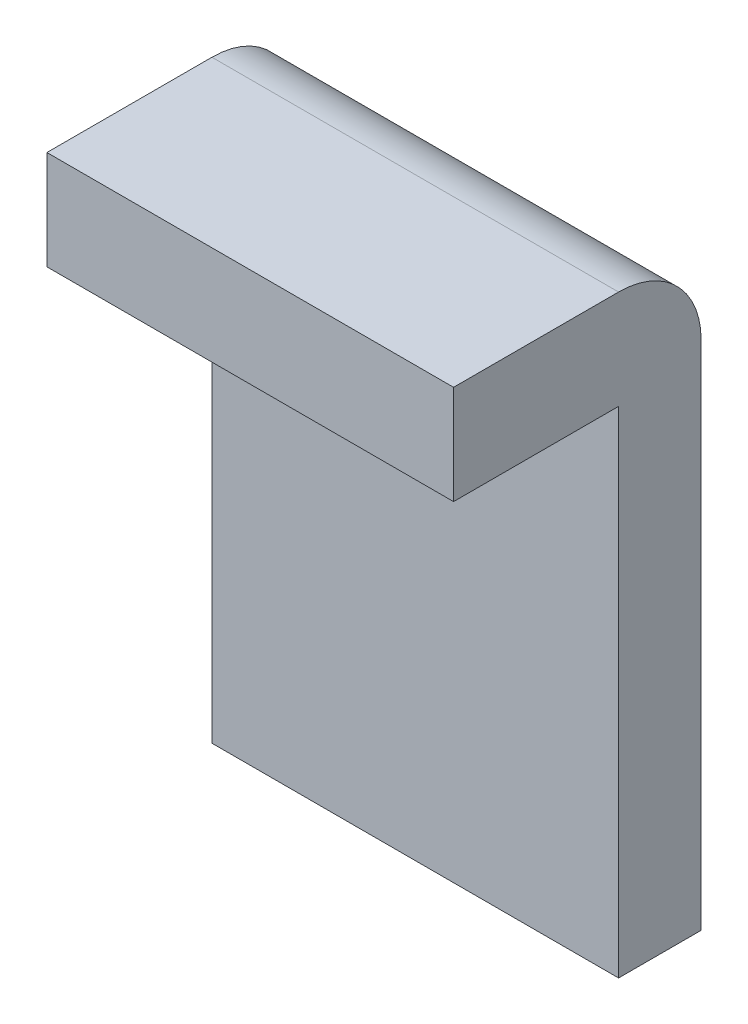
ISO-10303-21;
HEADER;
FILE_DESCRIPTION(('STEP AP214'),'2;1');
FILE_NAME('part.step','',(''),(''),'','','');
FILE_SCHEMA(('AUTOMOTIVE_DESIGN { 1 0 10303 214 1 1 1 1 }'));
ENDSEC;
DATA;
#1=APPLICATION_CONTEXT('core data for automotive mechanical design processes');
#2=APPLICATION_PROTOCOL_DEFINITION('international standard','automotive_design',2000,#1);
#3=PRODUCT_CONTEXT('',#1,'mechanical');
#4=PRODUCT('Part','Part','',(#3));
#5=PRODUCT_RELATED_PRODUCT_CATEGORY('part','',(#4));
#6=PRODUCT_DEFINITION_FORMATION('','',#4);
#7=PRODUCT_DEFINITION_CONTEXT('part definition',#1,'design');
#8=PRODUCT_DEFINITION('design','',#6,#7);
#9=PRODUCT_DEFINITION_SHAPE('','',#8);
#10=(LENGTH_UNIT() NAMED_UNIT(*) SI_UNIT(.MILLI.,.METRE.));
#11=(NAMED_UNIT(*) PLANE_ANGLE_UNIT() SI_UNIT($,.RADIAN.));
#12=(NAMED_UNIT(*) SI_UNIT($,.STERADIAN.) SOLID_ANGLE_UNIT());
#13=UNCERTAINTY_MEASURE_WITH_UNIT(LENGTH_MEASURE(1.E-05),#10,'distance_accuracy_value','');
#14=(GEOMETRIC_REPRESENTATION_CONTEXT(3) GLOBAL_UNCERTAINTY_ASSIGNED_CONTEXT((#13)) GLOBAL_UNIT_ASSIGNED_CONTEXT((#10,
#11,#12)) REPRESENTATION_CONTEXT('',''));
#15=CARTESIAN_POINT('',(0.,0.,0.));
#16=DIRECTION('',(0.,0.,1.));
#17=DIRECTION('',(1.,0.,0.));
#18=AXIS2_PLACEMENT_3D('',#15,#16,#17);
#19=CARTESIAN_POINT('',(-8.34906661620967,8.30000000000001,4.25467377707551));
#20=DIRECTION('',(0.,1.,0.));
#21=DIRECTION('',(0.,0.,1.));
#22=AXIS2_PLACEMENT_3D('',#19,#20,#21);
#23=PLANE('',#22);
#24=DIRECTION('',(1.,0.,0.));
#25=VECTOR('',#24,1.);
#26=CARTESIAN_POINT('',(-5.89065244584898,8.30000000000001,4.25467377707552));
#27=LINE('',#26,#25);
#28=CARTESIAN_POINT('',(-5.89065244584898,8.30000000000001,4.25467377707551));
#29=VERTEX_POINT('',#28);
#30=CARTESIAN_POINT('',(-4.65850168940825,8.30000000000001,4.25467377707551));
#31=VERTEX_POINT('',#30);
#32=EDGE_CURVE('E133',#29,#31,#27,.T.);
#33=ORIENTED_EDGE('',*,*,#32,.F.);
#34=DIRECTION('',(0.,0.,1.));
#35=VECTOR('',#34,1.);
#36=CARTESIAN_POINT('',(-5.89065244584898,8.30000000000001,4.25467377707553));
#37=LINE('',#36,#35);
#38=CARTESIAN_POINT('',(-5.89065244584898,8.30000000000001,3.75467377707551));
#39=VERTEX_POINT('',#38);
#40=EDGE_CURVE('E113',#39,#29,#37,.T.);
#41=ORIENTED_EDGE('',*,*,#40,.F.);
#42=DIRECTION('',(1.,0.,0.));
#43=VECTOR('',#42,1.);
#44=CARTESIAN_POINT('',(-8.34906661620967,8.30000000000001,3.75467377707551));
#45=LINE('',#44,#43);
#46=CARTESIAN_POINT('',(-4.65850168940825,8.30000000000001,3.75467377707551));
#47=VERTEX_POINT('',#46);
#48=EDGE_CURVE('E130',#39,#47,#45,.T.);
#49=ORIENTED_EDGE('',*,*,#48,.T.);
#50=DIRECTION('',(0.,0.,-1.));
#51=VECTOR('',#50,1.);
#52=CARTESIAN_POINT('',(-4.65850168940825,8.30000000000001,4.25467377707553));
#53=LINE('',#52,#51);
#54=EDGE_CURVE('E129',#31,#47,#53,.T.);
#55=ORIENTED_EDGE('',*,*,#54,.F.);
#56=EDGE_LOOP('',(#33,#41,#49,#55));
#57=FACE_BOUND('',#56,.T.);
#58=ADVANCED_FACE('F17',(#57),#23,.F.);
#59=CARTESIAN_POINT('',(-5.89065244584898,5.35753839337144,4.25467377707553));
#60=DIRECTION('',(0.,0.,1.));
#61=DIRECTION('',(0.,-1.,0.));
#62=AXIS2_PLACEMENT_3D('',#59,#60,#61);
#63=PLANE('',#62);
#64=DIRECTION('',(1.,0.,0.));
#65=VECTOR('',#64,1.);
#66=CARTESIAN_POINT('',(-8.34906661620967,8.6,4.25467377707551));
#67=LINE('',#66,#65);
#68=CARTESIAN_POINT('',(-4.65850168940825,8.6,4.25467377707551));
#69=VERTEX_POINT('',#68);
#70=CARTESIAN_POINT('',(-5.89065244584898,8.6,4.25467377707551));
#71=VERTEX_POINT('',#70);
#72=EDGE_CURVE('E131',#69,#71,#67,.F.);
#73=ORIENTED_EDGE('',*,*,#72,.T.);
#74=DIRECTION('',(0.,1.,0.));
#75=VECTOR('',#74,1.);
#76=CARTESIAN_POINT('',(-5.89065244584898,5.35753839337144,4.25467377707551));
#77=LINE('',#76,#75);
#78=EDGE_CURVE('E136',#29,#71,#77,.T.);
#79=ORIENTED_EDGE('',*,*,#78,.F.);
#80=ORIENTED_EDGE('',*,*,#32,.T.);
#81=DIRECTION('',(0.,1.,0.));
#82=VECTOR('',#81,1.);
#83=CARTESIAN_POINT('',(-4.65850168940825,5.35753839337144,4.25467377707551));
#84=LINE('',#83,#82);
#85=EDGE_CURVE('E120',#69,#31,#84,.F.);
#86=ORIENTED_EDGE('',*,*,#85,.F.);
#87=EDGE_LOOP('',(#73,#79,#80,#86));
#88=FACE_BOUND('',#87,.T.);
#89=ADVANCED_FACE('F172',(#88),#63,.T.);
#90=CARTESIAN_POINT('',(-8.34906661620967,8.6,4.25467377707551));
#91=DIRECTION('',(0.,-1.,0.));
#92=DIRECTION('',(0.,0.,-1.));
#93=AXIS2_PLACEMENT_3D('',#90,#91,#92);
#94=PLANE('',#93);
#95=DIRECTION('',(1.,0.,0.));
#96=VECTOR('',#95,1.);
#97=CARTESIAN_POINT('',(-8.34906661620967,8.6,3.75467377707551));
#98=LINE('',#97,#96);
#99=CARTESIAN_POINT('',(-5.89065244584898,8.6,3.7546737770755));
#100=VERTEX_POINT('',#99);
#101=CARTESIAN_POINT('',(-4.65850168940825,8.6,3.7546737770755));
#102=VERTEX_POINT('',#101);
#103=EDGE_CURVE('E79',#100,#102,#98,.T.);
#104=ORIENTED_EDGE('',*,*,#103,.F.);
#105=DIRECTION('',(0.,0.,1.));
#106=VECTOR('',#105,1.);
#107=CARTESIAN_POINT('',(-5.89065244584898,8.6,4.25467377707553));
#108=LINE('',#107,#106);
#109=EDGE_CURVE('E139',#71,#100,#108,.F.);
#110=ORIENTED_EDGE('',*,*,#109,.F.);
#111=ORIENTED_EDGE('',*,*,#72,.F.);
#112=DIRECTION('',(0.,0.,-1.));
#113=VECTOR('',#112,1.);
#114=CARTESIAN_POINT('',(-4.65850168940825,8.6,4.25467377707553));
#115=LINE('',#114,#113);
#116=EDGE_CURVE('E83',#102,#69,#115,.F.);
#117=ORIENTED_EDGE('',*,*,#116,.F.);
#118=EDGE_LOOP('',(#104,#110,#111,#117));
#119=FACE_BOUND('',#118,.T.);
#120=ADVANCED_FACE('F169',(#119),#94,.F.);
#121=CARTESIAN_POINT('',(-8.34906661620967,8.30000000000001,3.75467377707551));
#122=DIRECTION('',(0.,0.,-1.));
#123=DIRECTION('',(0.,1.,0.));
#124=AXIS2_PLACEMENT_3D('',#121,#122,#123);
#125=PLANE('',#124);
#126=ORIENTED_EDGE('',*,*,#48,.F.);
#127=DIRECTION('',(0.,1.,0.));
#128=VECTOR('',#127,1.);
#129=CARTESIAN_POINT('',(-5.89065244584898,5.35753839337144,3.75467377707551));
#130=LINE('',#129,#128);
#131=CARTESIAN_POINT('',(-5.89065244584898,6.8,3.75467377707551));
#132=VERTEX_POINT('',#131);
#133=EDGE_CURVE('E95',#132,#39,#130,.T.);
#134=ORIENTED_EDGE('',*,*,#133,.F.);
#135=DIRECTION('',(1.,0.,0.));
#136=VECTOR('',#135,1.);
#137=CARTESIAN_POINT('',(-15.8147962412963,6.8,3.75467377707551));
#138=LINE('',#137,#136);
#139=CARTESIAN_POINT('',(-4.65850168940825,6.8,3.75467377707551));
#140=VERTEX_POINT('',#139);
#141=EDGE_CURVE('E114',#140,#132,#138,.F.);
#142=ORIENTED_EDGE('',*,*,#141,.F.);
#143=DIRECTION('',(0.,1.,0.));
#144=VECTOR('',#143,1.);
#145=CARTESIAN_POINT('',(-4.65850168940825,5.35753839337144,3.75467377707551));
#146=LINE('',#145,#144);
#147=EDGE_CURVE('E84',#47,#140,#146,.F.);
#148=ORIENTED_EDGE('',*,*,#147,.F.);
#149=EDGE_LOOP('',(#126,#134,#142,#148));
#150=FACE_BOUND('',#149,.T.);
#151=ADVANCED_FACE('F178',(#150),#125,.F.);
#152=CARTESIAN_POINT('',(-8.34906661620967,8.35,3.7546737770755));
#153=DIRECTION('',(1.,0.,0.));
#154=DIRECTION('',(0.,0.,-1.));
#155=AXIS2_PLACEMENT_3D('',#152,#153,#154);
#156=CYLINDRICAL_SURFACE('',#155,0.249999999999996);
#157=CARTESIAN_POINT('',(-5.89065244584898,8.35,3.7546737770755));
#158=DIRECTION('',(1.,0.,0.));
#159=DIRECTION('',(0.,0.,-1.));
#160=AXIS2_PLACEMENT_3D('',#157,#158,#159);
#161=CIRCLE('',#160,0.249999999999996);
#162=CARTESIAN_POINT('',(-5.89065244584898,8.35,3.50467377707551));
#163=VERTEX_POINT('',#162);
#164=EDGE_CURVE('E106',#100,#163,#161,.F.);
#165=ORIENTED_EDGE('',*,*,#164,.F.);
#166=ORIENTED_EDGE('',*,*,#103,.T.);
#167=CARTESIAN_POINT('',(-4.65850168940825,8.35,3.7546737770755));
#168=DIRECTION('',(1.,0.,0.));
#169=DIRECTION('',(0.,0.,-1.));
#170=AXIS2_PLACEMENT_3D('',#167,#168,#169);
#171=CIRCLE('',#170,0.249999999999996);
#172=CARTESIAN_POINT('',(-4.65850168940825,8.35,3.50467377707551));
#173=VERTEX_POINT('',#172);
#174=EDGE_CURVE('E20',#173,#102,#171,.T.);
#175=ORIENTED_EDGE('',*,*,#174,.F.);
#176=DIRECTION('',(1.,0.,0.));
#177=VECTOR('',#176,1.);
#178=CARTESIAN_POINT('',(-5.89065244584898,8.35,3.50467377707551));
#179=LINE('',#178,#177);
#180=EDGE_CURVE('E77',#163,#173,#179,.T.);
#181=ORIENTED_EDGE('',*,*,#180,.F.);
#182=EDGE_LOOP('',(#165,#166,#175,#181));
#183=FACE_BOUND('',#182,.T.);
#184=ADVANCED_FACE('F75',(#183),#156,.T.);
#185=CARTESIAN_POINT('',(-4.65850168940825,5.35753839337144,4.25467377707553));
#186=DIRECTION('',(1.,0.,0.));
#187=DIRECTION('',(0.,0.,-1.));
#188=AXIS2_PLACEMENT_3D('',#185,#186,#187);
#189=PLANE('',#188);
#190=ORIENTED_EDGE('',*,*,#116,.T.);
#191=ORIENTED_EDGE('',*,*,#85,.T.);
#192=ORIENTED_EDGE('',*,*,#54,.T.);
#193=ORIENTED_EDGE('',*,*,#147,.T.);
#194=DIRECTION('',(0.,0.,-1.));
#195=VECTOR('',#194,1.);
#196=CARTESIAN_POINT('',(-4.65850168940825,6.80000000000003,12.5046737770755));
#197=LINE('',#196,#195);
#198=CARTESIAN_POINT('',(-4.65850168940825,6.8,3.50467377707552));
#199=VERTEX_POINT('',#198);
#200=EDGE_CURVE('E90',#199,#140,#197,.F.);
#201=ORIENTED_EDGE('',*,*,#200,.F.);
#202=DIRECTION('',(0.,1.,0.));
#203=VECTOR('',#202,1.);
#204=CARTESIAN_POINT('',(-4.65850168940825,5.35753839337143,3.50467377707553));
#205=LINE('',#204,#203);
#206=EDGE_CURVE('E86',#173,#199,#205,.F.);
#207=ORIENTED_EDGE('',*,*,#206,.F.);
#208=ORIENTED_EDGE('',*,*,#174,.T.);
#209=EDGE_LOOP('',(#190,#191,#192,#193,#201,#207,#208));
#210=FACE_BOUND('',#209,.T.);
#211=ADVANCED_FACE('F87',(#210),#189,.T.);
#212=CARTESIAN_POINT('',(-15.8147962412963,6.80000000000003,12.5046737770755));
#213=DIRECTION('',(0.,-1.,0.));
#214=DIRECTION('',(0.,0.,-1.));
#215=AXIS2_PLACEMENT_3D('',#212,#213,#214);
#216=PLANE('',#215);
#217=DIRECTION('',(1.,0.,0.));
#218=VECTOR('',#217,1.);
#219=CARTESIAN_POINT('',(-5.89065244584898,6.8,3.50467377707552));
#220=LINE('',#219,#218);
#221=CARTESIAN_POINT('',(-5.89065244584898,6.8,3.50467377707552));
#222=VERTEX_POINT('',#221);
#223=EDGE_CURVE('E26',#199,#222,#220,.F.);
#224=ORIENTED_EDGE('',*,*,#223,.F.);
#225=ORIENTED_EDGE('',*,*,#200,.T.);
#226=ORIENTED_EDGE('',*,*,#141,.T.);
#227=DIRECTION('',(0.,0.,1.));
#228=VECTOR('',#227,1.);
#229=CARTESIAN_POINT('',(-5.89065244584898,6.8,4.25467377707553));
#230=LINE('',#229,#228);
#231=EDGE_CURVE('E35',#222,#132,#230,.T.);
#232=ORIENTED_EDGE('',*,*,#231,.F.);
#233=EDGE_LOOP('',(#224,#225,#226,#232));
#234=FACE_BOUND('',#233,.T.);
#235=ADVANCED_FACE('F179',(#234),#216,.T.);
#236=CARTESIAN_POINT('',(-5.89065244584898,5.35753839337144,4.25467377707553));
#237=DIRECTION('',(-1.,0.,0.));
#238=DIRECTION('',(0.,0.,1.));
#239=AXIS2_PLACEMENT_3D('',#236,#237,#238);
#240=PLANE('',#239);
#241=ORIENTED_EDGE('',*,*,#231,.T.);
#242=ORIENTED_EDGE('',*,*,#133,.T.);
#243=ORIENTED_EDGE('',*,*,#40,.T.);
#244=ORIENTED_EDGE('',*,*,#78,.T.);
#245=ORIENTED_EDGE('',*,*,#109,.T.);
#246=ORIENTED_EDGE('',*,*,#164,.T.);
#247=DIRECTION('',(0.,1.,0.));
#248=VECTOR('',#247,1.);
#249=CARTESIAN_POINT('',(-5.89065244584898,5.35753839337143,3.50467377707553));
#250=LINE('',#249,#248);
#251=EDGE_CURVE('E11',#222,#163,#250,.T.);
#252=ORIENTED_EDGE('',*,*,#251,.F.);
#253=EDGE_LOOP('',(#241,#242,#243,#244,#245,#246,#252));
#254=FACE_BOUND('',#253,.T.);
#255=ADVANCED_FACE('F166',(#254),#240,.T.);
#256=CARTESIAN_POINT('',(-5.89065244584898,5.35753839337143,3.50467377707553));
#257=DIRECTION('',(0.,0.,-1.));
#258=DIRECTION('',(0.,1.,0.));
#259=AXIS2_PLACEMENT_3D('',#256,#257,#258);
#260=PLANE('',#259);
#261=ORIENTED_EDGE('',*,*,#223,.T.);
#262=ORIENTED_EDGE('',*,*,#251,.T.);
#263=ORIENTED_EDGE('',*,*,#180,.T.);
#264=ORIENTED_EDGE('',*,*,#206,.T.);
#265=EDGE_LOOP('',(#261,#262,#263,#264));
#266=FACE_BOUND('',#265,.T.);
#267=ADVANCED_FACE('F94',(#266),#260,.T.);
#268=CLOSED_SHELL('',(#58,#89,#120,#151,#184,#211,#235,#255,#267));
#269=MANIFOLD_SOLID_BREP('B1',#268);
#270=ADVANCED_BREP_SHAPE_REPRESENTATION('',(#18,#269),#14);
#271=SHAPE_DEFINITION_REPRESENTATION(#9,#270);
ENDSEC;
END-ISO-10303-21;
